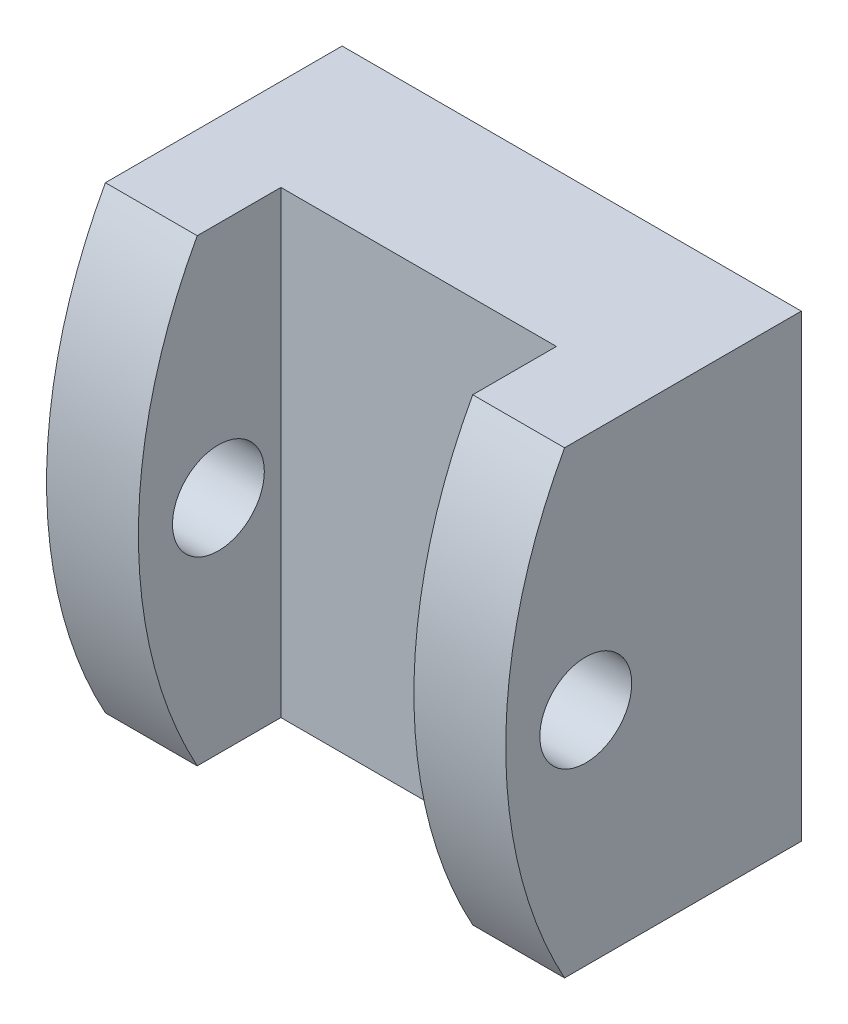
ISO-10303-21;
HEADER;
FILE_DESCRIPTION(('STEP AP214'),'2;1');
FILE_NAME('part.step','',(''),(''),'','','');
FILE_SCHEMA(('AUTOMOTIVE_DESIGN { 1 0 10303 214 1 1 1 1 }'));
ENDSEC;
DATA;
#1=APPLICATION_CONTEXT('core data for automotive mechanical design processes');
#2=APPLICATION_PROTOCOL_DEFINITION('international standard','automotive_design',2000,#1);
#3=PRODUCT_CONTEXT('',#1,'mechanical');
#4=PRODUCT('Part','Part','',(#3));
#5=PRODUCT_RELATED_PRODUCT_CATEGORY('part','',(#4));
#6=PRODUCT_DEFINITION_FORMATION('','',#4);
#7=PRODUCT_DEFINITION_CONTEXT('part definition',#1,'design');
#8=PRODUCT_DEFINITION('design','',#6,#7);
#9=PRODUCT_DEFINITION_SHAPE('','',#8);
#10=(LENGTH_UNIT() NAMED_UNIT(*) SI_UNIT(.MILLI.,.METRE.));
#11=(NAMED_UNIT(*) PLANE_ANGLE_UNIT() SI_UNIT($,.RADIAN.));
#12=(NAMED_UNIT(*) SI_UNIT($,.STERADIAN.) SOLID_ANGLE_UNIT());
#13=UNCERTAINTY_MEASURE_WITH_UNIT(LENGTH_MEASURE(1.E-05),#10,'distance_accuracy_value','');
#14=(GEOMETRIC_REPRESENTATION_CONTEXT(3) GLOBAL_UNCERTAINTY_ASSIGNED_CONTEXT((#13)) GLOBAL_UNIT_ASSIGNED_CONTEXT((#10,
#11,#12)) REPRESENTATION_CONTEXT('',''));
#15=CARTESIAN_POINT('',(0.,0.,0.));
#16=DIRECTION('',(0.,0.,1.));
#17=DIRECTION('',(1.,0.,0.));
#18=AXIS2_PLACEMENT_3D('',#15,#16,#17);
#19=CARTESIAN_POINT('',(0.,0.,5.));
#20=DIRECTION('',(-1.,0.,0.));
#21=DIRECTION('',(0.,0.,1.));
#22=AXIS2_PLACEMENT_3D('',#19,#20,#21);
#23=PLANE('',#22);
#24=CARTESIAN_POINT('',(0.,-7.76248029614629,7.04138911613754));
#25=DIRECTION('',(1.,0.,0.));
#26=DIRECTION('',(0.,0.,-1.));
#27=AXIS2_PLACEMENT_3D('',#24,#25,#26);
#28=CIRCLE('',#27,1.5);
#29=CARTESIAN_POINT('',(0.,-7.76248029614629,5.54138911613754));
#30=VERTEX_POINT('',#29);
#31=EDGE_CURVE('E166',#30,#30,#28,.T.);
#32=ORIENTED_EDGE('',*,*,#31,.F.);
#33=EDGE_LOOP('',(#32));
#34=FACE_BOUND('',#33,.T.);
#35=CARTESIAN_POINT('',(0.,-7.5,-5.94512453601259));
#36=DIRECTION('',(1.,0.,0.));
#37=DIRECTION('',(0.,0.,-1.));
#38=AXIS2_PLACEMENT_3D('',#35,#36,#37);
#39=CIRCLE('',#38,15.5999742941684);
#40=CARTESIAN_POINT('',(0.,0.,7.73366188598822));
#41=VERTEX_POINT('',#40);
#42=CARTESIAN_POINT('',(0.,-15.,7.73366188598822));
#43=VERTEX_POINT('',#42);
#44=EDGE_CURVE('E99',#41,#43,#39,.T.);
#45=ORIENTED_EDGE('',*,*,#44,.T.);
#46=DIRECTION('',(0.,0.,-1.));
#47=VECTOR('',#46,1.);
#48=CARTESIAN_POINT('',(0.,-15.,5.));
#49=LINE('',#48,#47);
#50=CARTESIAN_POINT('',(0.,-15.,0.));
#51=VERTEX_POINT('',#50);
#52=EDGE_CURVE('E126',#43,#51,#49,.T.);
#53=ORIENTED_EDGE('',*,*,#52,.T.);
#54=DIRECTION('',(0.,1.,0.));
#55=VECTOR('',#54,1.);
#56=CARTESIAN_POINT('',(0.,0.,0.));
#57=LINE('',#56,#55);
#58=CARTESIAN_POINT('',(0.,0.,0.));
#59=VERTEX_POINT('',#58);
#60=EDGE_CURVE('E119',#51,#59,#57,.T.);
#61=ORIENTED_EDGE('',*,*,#60,.T.);
#62=DIRECTION('',(0.,0.,-1.));
#63=VECTOR('',#62,1.);
#64=CARTESIAN_POINT('',(0.,0.,5.));
#65=LINE('',#64,#63);
#66=EDGE_CURVE('E45',#41,#59,#65,.T.);
#67=ORIENTED_EDGE('',*,*,#66,.F.);
#68=EDGE_LOOP('',(#45,#53,#61,#67));
#69=FACE_BOUND('',#68,.T.);
#70=ADVANCED_FACE('F37',(#34,#69),#23,.F.);
#71=CARTESIAN_POINT('',(0.,0.,5.));
#72=DIRECTION('',(0.,-1.,0.));
#73=DIRECTION('',(1.,0.,0.));
#74=AXIS2_PLACEMENT_3D('',#71,#72,#73);
#75=PLANE('',#74);
#76=DIRECTION('',(1.,0.,0.));
#77=VECTOR('',#76,1.);
#78=CARTESIAN_POINT('',(-18.,0.,7.73366188598822));
#79=LINE('',#78,#77);
#80=CARTESIAN_POINT('',(-3.,0.,7.73366188598822));
#81=VERTEX_POINT('',#80);
#82=EDGE_CURVE('E52',#81,#41,#79,.T.);
#83=ORIENTED_EDGE('',*,*,#82,.T.);
#84=ORIENTED_EDGE('',*,*,#66,.T.);
#85=DIRECTION('',(-1.,0.,0.));
#86=VECTOR('',#85,1.);
#87=CARTESIAN_POINT('',(0.,0.,0.));
#88=LINE('',#87,#86);
#89=CARTESIAN_POINT('',(-15.,0.,0.));
#90=VERTEX_POINT('',#89);
#91=EDGE_CURVE('E136',#59,#90,#88,.T.);
#92=ORIENTED_EDGE('',*,*,#91,.T.);
#93=DIRECTION('',(0.,0.,-1.));
#94=VECTOR('',#93,1.);
#95=CARTESIAN_POINT('',(-15.,0.,5.));
#96=LINE('',#95,#94);
#97=CARTESIAN_POINT('',(-15.,0.,7.73366188598822));
#98=VERTEX_POINT('',#97);
#99=EDGE_CURVE('E120',#98,#90,#96,.T.);
#100=ORIENTED_EDGE('',*,*,#99,.F.);
#101=CARTESIAN_POINT('',(-12.,0.,7.73366188598822));
#102=VERTEX_POINT('',#101);
#103=EDGE_CURVE('E115',#98,#102,#79,.T.);
#104=ORIENTED_EDGE('',*,*,#103,.T.);
#105=DIRECTION('',(0.,0.,-1.));
#106=VECTOR('',#105,1.);
#107=CARTESIAN_POINT('',(-12.,0.,10.));
#108=LINE('',#107,#106);
#109=CARTESIAN_POINT('',(-12.,0.,5.));
#110=VERTEX_POINT('',#109);
#111=EDGE_CURVE('E152',#102,#110,#108,.T.);
#112=ORIENTED_EDGE('',*,*,#111,.T.);
#113=DIRECTION('',(-1.,0.,0.));
#114=VECTOR('',#113,1.);
#115=CARTESIAN_POINT('',(0.,0.,5.));
#116=LINE('',#115,#114);
#117=CARTESIAN_POINT('',(-3.,0.,5.));
#118=VERTEX_POINT('',#117);
#119=EDGE_CURVE('E132',#118,#110,#116,.T.);
#120=ORIENTED_EDGE('',*,*,#119,.F.);
#121=DIRECTION('',(0.,0.,-1.));
#122=VECTOR('',#121,1.);
#123=CARTESIAN_POINT('',(-3.,0.,10.));
#124=LINE('',#123,#122);
#125=EDGE_CURVE('E114',#81,#118,#124,.T.);
#126=ORIENTED_EDGE('',*,*,#125,.F.);
#127=EDGE_LOOP('',(#83,#84,#92,#100,#104,#112,#120,#126));
#128=FACE_BOUND('',#127,.T.);
#129=ADVANCED_FACE('F110',(#128),#75,.F.);
#130=CARTESIAN_POINT('',(-15.,0.,5.));
#131=DIRECTION('',(1.,0.,0.));
#132=DIRECTION('',(0.,1.,0.));
#133=AXIS2_PLACEMENT_3D('',#130,#131,#132);
#134=PLANE('',#133);
#135=CARTESIAN_POINT('',(-15.,-7.76248029614629,7.04138911613754));
#136=DIRECTION('',(1.,0.,0.));
#137=DIRECTION('',(0.,0.,-1.));
#138=AXIS2_PLACEMENT_3D('',#135,#136,#137);
#139=CIRCLE('',#138,1.5);
#140=CARTESIAN_POINT('',(-15.,-7.76248029614629,5.54138911613754));
#141=VERTEX_POINT('',#140);
#142=EDGE_CURVE('E163',#141,#141,#139,.T.);
#143=ORIENTED_EDGE('',*,*,#142,.T.);
#144=EDGE_LOOP('',(#143));
#145=FACE_BOUND('',#144,.T.);
#146=CARTESIAN_POINT('',(-15.,-7.5,-5.94512453601259));
#147=DIRECTION('',(1.,0.,0.));
#148=DIRECTION('',(0.,1.,0.));
#149=AXIS2_PLACEMENT_3D('',#146,#147,#148);
#150=CIRCLE('',#149,15.5999742941684);
#151=CARTESIAN_POINT('',(-15.,-15.,7.73366188598822));
#152=VERTEX_POINT('',#151);
#153=EDGE_CURVE('E156',#98,#152,#150,.T.);
#154=ORIENTED_EDGE('',*,*,#153,.F.);
#155=ORIENTED_EDGE('',*,*,#99,.T.);
#156=DIRECTION('',(0.,-1.,0.));
#157=VECTOR('',#156,1.);
#158=CARTESIAN_POINT('',(-15.,0.,0.));
#159=LINE('',#158,#157);
#160=CARTESIAN_POINT('',(-15.,-15.,0.));
#161=VERTEX_POINT('',#160);
#162=EDGE_CURVE('E133',#90,#161,#159,.T.);
#163=ORIENTED_EDGE('',*,*,#162,.T.);
#164=DIRECTION('',(0.,0.,-1.));
#165=VECTOR('',#164,1.);
#166=CARTESIAN_POINT('',(-15.,-15.,5.));
#167=LINE('',#166,#165);
#168=EDGE_CURVE('E122',#152,#161,#167,.T.);
#169=ORIENTED_EDGE('',*,*,#168,.F.);
#170=EDGE_LOOP('',(#154,#155,#163,#169));
#171=FACE_BOUND('',#170,.T.);
#172=ADVANCED_FACE('F177',(#145,#171),#134,.F.);
#173=CARTESIAN_POINT('',(0.,-15.,5.));
#174=DIRECTION('',(0.,1.,0.));
#175=DIRECTION('',(-1.,0.,0.));
#176=AXIS2_PLACEMENT_3D('',#173,#174,#175);
#177=PLANE('',#176);
#178=DIRECTION('',(1.,0.,0.));
#179=VECTOR('',#178,1.);
#180=CARTESIAN_POINT('',(-18.,-15.,7.73366188598822));
#181=LINE('',#180,#179);
#182=CARTESIAN_POINT('',(-12.,-15.,7.73366188598822));
#183=VERTEX_POINT('',#182);
#184=EDGE_CURVE('E59',#152,#183,#181,.T.);
#185=ORIENTED_EDGE('',*,*,#184,.F.);
#186=ORIENTED_EDGE('',*,*,#168,.T.);
#187=DIRECTION('',(1.,0.,0.));
#188=VECTOR('',#187,1.);
#189=CARTESIAN_POINT('',(0.,-15.,0.));
#190=LINE('',#189,#188);
#191=EDGE_CURVE('E129',#161,#51,#190,.T.);
#192=ORIENTED_EDGE('',*,*,#191,.T.);
#193=ORIENTED_EDGE('',*,*,#52,.F.);
#194=CARTESIAN_POINT('',(-3.,-15.,7.73366188598822));
#195=VERTEX_POINT('',#194);
#196=EDGE_CURVE('E102',#195,#43,#181,.T.);
#197=ORIENTED_EDGE('',*,*,#196,.F.);
#198=DIRECTION('',(0.,0.,-1.));
#199=VECTOR('',#198,1.);
#200=CARTESIAN_POINT('',(-3.,-15.,10.));
#201=LINE('',#200,#199);
#202=CARTESIAN_POINT('',(-3.,-15.,5.));
#203=VERTEX_POINT('',#202);
#204=EDGE_CURVE('E139',#195,#203,#201,.T.);
#205=ORIENTED_EDGE('',*,*,#204,.T.);
#206=DIRECTION('',(1.,0.,0.));
#207=VECTOR('',#206,1.);
#208=CARTESIAN_POINT('',(0.,-15.,5.));
#209=LINE('',#208,#207);
#210=CARTESIAN_POINT('',(-12.,-15.,5.));
#211=VERTEX_POINT('',#210);
#212=EDGE_CURVE('E128',#211,#203,#209,.T.);
#213=ORIENTED_EDGE('',*,*,#212,.F.);
#214=DIRECTION('',(0.,0.,-1.));
#215=VECTOR('',#214,1.);
#216=CARTESIAN_POINT('',(-12.,-15.,10.));
#217=LINE('',#216,#215);
#218=EDGE_CURVE('E154',#183,#211,#217,.T.);
#219=ORIENTED_EDGE('',*,*,#218,.F.);
#220=EDGE_LOOP('',(#185,#186,#192,#193,#197,#205,#213,#219));
#221=FACE_BOUND('',#220,.T.);
#222=ADVANCED_FACE('F181',(#221),#177,.F.);
#223=CARTESIAN_POINT('',(-3.,0.,10.));
#224=DIRECTION('',(1.,0.,0.));
#225=DIRECTION('',(0.,1.,0.));
#226=AXIS2_PLACEMENT_3D('',#223,#224,#225);
#227=PLANE('',#226);
#228=CARTESIAN_POINT('',(-3.,-7.76248029614629,7.04138911613754));
#229=DIRECTION('',(1.,0.,0.));
#230=DIRECTION('',(0.,1.,0.));
#231=AXIS2_PLACEMENT_3D('',#228,#229,#230);
#232=CIRCLE('',#231,1.5);
#233=CARTESIAN_POINT('',(-3.,-6.26248029614629,7.04138911613754));
#234=VERTEX_POINT('',#233);
#235=EDGE_CURVE('E106',#234,#234,#232,.T.);
#236=ORIENTED_EDGE('',*,*,#235,.T.);
#237=EDGE_LOOP('',(#236));
#238=FACE_BOUND('',#237,.T.);
#239=CARTESIAN_POINT('',(-3.,-7.5,-5.94512453601259));
#240=DIRECTION('',(1.,0.,0.));
#241=DIRECTION('',(0.,1.,0.));
#242=AXIS2_PLACEMENT_3D('',#239,#240,#241);
#243=CIRCLE('',#242,15.5999742941684);
#244=EDGE_CURVE('E158',#81,#195,#243,.T.);
#245=ORIENTED_EDGE('',*,*,#244,.F.);
#246=ORIENTED_EDGE('',*,*,#125,.T.);
#247=DIRECTION('',(0.,-1.,0.));
#248=VECTOR('',#247,1.);
#249=CARTESIAN_POINT('',(-3.,0.,5.));
#250=LINE('',#249,#248);
#251=EDGE_CURVE('E146',#118,#203,#250,.T.);
#252=ORIENTED_EDGE('',*,*,#251,.T.);
#253=ORIENTED_EDGE('',*,*,#204,.F.);
#254=EDGE_LOOP('',(#245,#246,#252,#253));
#255=FACE_BOUND('',#254,.T.);
#256=ADVANCED_FACE('F187',(#238,#255),#227,.F.);
#257=CARTESIAN_POINT('',(-12.,0.,10.));
#258=DIRECTION('',(-1.,0.,0.));
#259=DIRECTION('',(0.,-1.,0.));
#260=AXIS2_PLACEMENT_3D('',#257,#258,#259);
#261=PLANE('',#260);
#262=CARTESIAN_POINT('',(-12.,-7.76248029614629,7.04138911613754));
#263=DIRECTION('',(-1.,0.,0.));
#264=DIRECTION('',(0.,-1.,0.));
#265=AXIS2_PLACEMENT_3D('',#262,#263,#264);
#266=CIRCLE('',#265,1.5);
#267=CARTESIAN_POINT('',(-12.,-9.26248029614629,7.04138911613754));
#268=VERTEX_POINT('',#267);
#269=EDGE_CURVE('E40',#268,#268,#266,.T.);
#270=ORIENTED_EDGE('',*,*,#269,.T.);
#271=EDGE_LOOP('',(#270));
#272=FACE_BOUND('',#271,.T.);
#273=CARTESIAN_POINT('',(-12.,-7.5,-5.94512453601259));
#274=DIRECTION('',(-1.,0.,0.));
#275=DIRECTION('',(0.,-1.,0.));
#276=AXIS2_PLACEMENT_3D('',#273,#274,#275);
#277=CIRCLE('',#276,15.5999742941684);
#278=EDGE_CURVE('E11',#183,#102,#277,.T.);
#279=ORIENTED_EDGE('',*,*,#278,.F.);
#280=ORIENTED_EDGE('',*,*,#218,.T.);
#281=DIRECTION('',(0.,1.,0.));
#282=VECTOR('',#281,1.);
#283=CARTESIAN_POINT('',(-12.,0.,5.));
#284=LINE('',#283,#282);
#285=EDGE_CURVE('E149',#211,#110,#284,.T.);
#286=ORIENTED_EDGE('',*,*,#285,.T.);
#287=ORIENTED_EDGE('',*,*,#111,.F.);
#288=EDGE_LOOP('',(#279,#280,#286,#287));
#289=FACE_BOUND('',#288,.T.);
#290=ADVANCED_FACE('F197',(#272,#289),#261,.F.);
#291=CARTESIAN_POINT('',(0.,0.,5.));
#292=DIRECTION('',(0.,0.,-1.));
#293=DIRECTION('',(-1.,0.,0.));
#294=AXIS2_PLACEMENT_3D('',#291,#292,#293);
#295=PLANE('',#294);
#296=ORIENTED_EDGE('',*,*,#285,.F.);
#297=ORIENTED_EDGE('',*,*,#212,.T.);
#298=ORIENTED_EDGE('',*,*,#251,.F.);
#299=ORIENTED_EDGE('',*,*,#119,.T.);
#300=EDGE_LOOP('',(#296,#297,#298,#299));
#301=FACE_BOUND('',#300,.T.);
#302=ADVANCED_FACE('F193',(#301),#295,.F.);
#303=CARTESIAN_POINT('',(0.,0.,0.));
#304=DIRECTION('',(0.,0.,-1.));
#305=DIRECTION('',(-1.,0.,0.));
#306=AXIS2_PLACEMENT_3D('',#303,#304,#305);
#307=PLANE('',#306);
#308=ORIENTED_EDGE('',*,*,#60,.F.);
#309=ORIENTED_EDGE('',*,*,#191,.F.);
#310=ORIENTED_EDGE('',*,*,#162,.F.);
#311=ORIENTED_EDGE('',*,*,#91,.F.);
#312=EDGE_LOOP('',(#308,#309,#310,#311));
#313=FACE_BOUND('',#312,.T.);
#314=ADVANCED_FACE('F189',(#313),#307,.T.);
#315=CARTESIAN_POINT('',(-18.,-7.5,-5.94512453601259));
#316=DIRECTION('',(1.,0.,0.));
#317=DIRECTION('',(0.,0.,-1.));
#318=AXIS2_PLACEMENT_3D('',#315,#316,#317);
#319=CYLINDRICAL_SURFACE('',#318,15.5999742941684);
#320=ORIENTED_EDGE('',*,*,#153,.T.);
#321=ORIENTED_EDGE('',*,*,#184,.T.);
#322=ORIENTED_EDGE('',*,*,#278,.T.);
#323=ORIENTED_EDGE('',*,*,#103,.F.);
#324=EDGE_LOOP('',(#320,#321,#322,#323));
#325=FACE_BOUND('',#324,.T.);
#326=ADVANCED_FACE('F192',(#325),#319,.T.);
#327=ORIENTED_EDGE('',*,*,#244,.T.);
#328=ORIENTED_EDGE('',*,*,#196,.T.);
#329=ORIENTED_EDGE('',*,*,#44,.F.);
#330=ORIENTED_EDGE('',*,*,#82,.F.);
#331=EDGE_LOOP('',(#327,#328,#329,#330));
#332=FACE_BOUND('',#331,.T.);
#333=ADVANCED_FACE('F100',(#332),#319,.T.);
#334=CARTESIAN_POINT('',(-15.,-7.76248029614629,7.04138911613754));
#335=DIRECTION('',(1.,0.,0.));
#336=DIRECTION('',(0.,0.,-1.));
#337=AXIS2_PLACEMENT_3D('',#334,#335,#336);
#338=CYLINDRICAL_SURFACE('',#337,1.5);
#339=ORIENTED_EDGE('',*,*,#142,.F.);
#340=EDGE_LOOP('',(#339));
#341=FACE_BOUND('',#340,.T.);
#342=ORIENTED_EDGE('',*,*,#269,.F.);
#343=EDGE_LOOP('',(#342));
#344=FACE_BOUND('',#343,.T.);
#345=ADVANCED_FACE('F208',(#341,#344),#338,.F.);
#346=ORIENTED_EDGE('',*,*,#31,.T.);
#347=EDGE_LOOP('',(#346));
#348=FACE_BOUND('',#347,.T.);
#349=ORIENTED_EDGE('',*,*,#235,.F.);
#350=EDGE_LOOP('',(#349));
#351=FACE_BOUND('',#350,.T.);
#352=ADVANCED_FACE('F170',(#348,#351),#338,.F.);
#353=CLOSED_SHELL('',(#70,#129,#172,#222,#256,#290,#302,#314,#326,#333,#345,#352));
#354=MANIFOLD_SOLID_BREP('B2',#353);
#355=ADVANCED_BREP_SHAPE_REPRESENTATION('',(#18,#354),#14);
#356=SHAPE_DEFINITION_REPRESENTATION(#9,#355);
ENDSEC;
END-ISO-10303-21;
